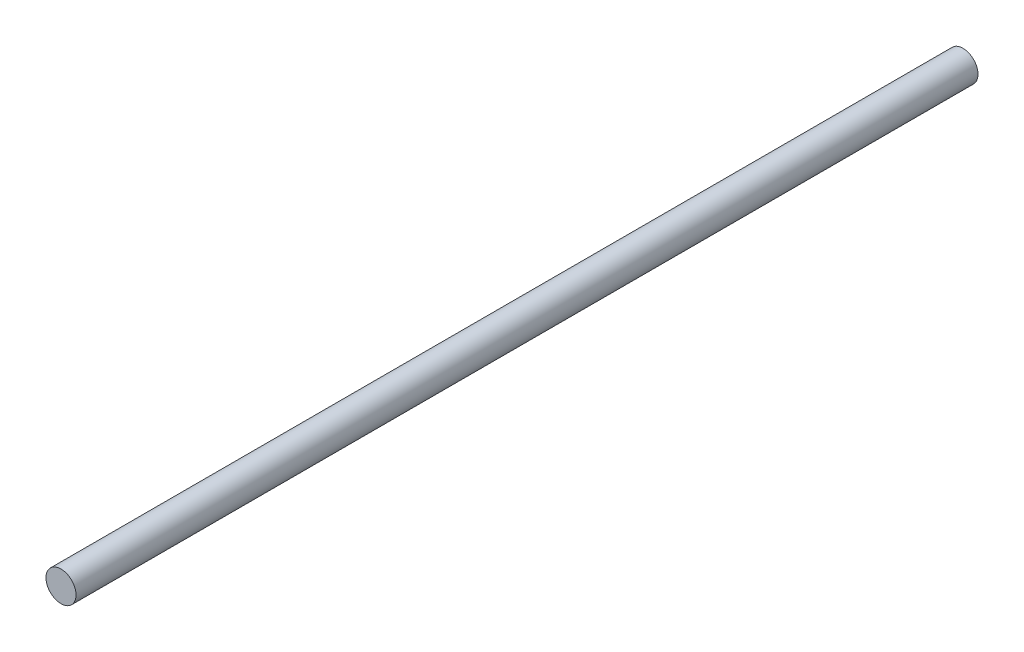
ISO-10303-21;
HEADER;
FILE_DESCRIPTION(('STEP AP214'),'2;1');
FILE_NAME('part.step','',(''),(''),'','','');
FILE_SCHEMA(('AUTOMOTIVE_DESIGN { 1 0 10303 214 1 1 1 1 }'));
ENDSEC;
DATA;
#1=APPLICATION_CONTEXT('core data for automotive mechanical design processes');
#2=APPLICATION_PROTOCOL_DEFINITION('international standard','automotive_design',2000,#1);
#3=PRODUCT_CONTEXT('',#1,'mechanical');
#4=PRODUCT('Part','Part','',(#3));
#5=PRODUCT_RELATED_PRODUCT_CATEGORY('part','',(#4));
#6=PRODUCT_DEFINITION_FORMATION('','',#4);
#7=PRODUCT_DEFINITION_CONTEXT('part definition',#1,'design');
#8=PRODUCT_DEFINITION('design','',#6,#7);
#9=PRODUCT_DEFINITION_SHAPE('','',#8);
#10=(LENGTH_UNIT() NAMED_UNIT(*) SI_UNIT(.MILLI.,.METRE.));
#11=(NAMED_UNIT(*) PLANE_ANGLE_UNIT() SI_UNIT($,.RADIAN.));
#12=(NAMED_UNIT(*) SI_UNIT($,.STERADIAN.) SOLID_ANGLE_UNIT());
#13=UNCERTAINTY_MEASURE_WITH_UNIT(LENGTH_MEASURE(1.E-05),#10,'distance_accuracy_value','');
#14=(GEOMETRIC_REPRESENTATION_CONTEXT(3) GLOBAL_UNCERTAINTY_ASSIGNED_CONTEXT((#13)) GLOBAL_UNIT_ASSIGNED_CONTEXT((#10,
#11,#12)) REPRESENTATION_CONTEXT('',''));
#15=CARTESIAN_POINT('',(0.,0.,0.));
#16=DIRECTION('',(0.,0.,1.));
#17=DIRECTION('',(1.,0.,0.));
#18=AXIS2_PLACEMENT_3D('',#15,#16,#17);
#19=CARTESIAN_POINT('',(0.,0.,300.));
#20=DIRECTION('',(0.,0.,-1.));
#21=DIRECTION('',(-1.,0.,0.));
#22=AXIS2_PLACEMENT_3D('',#19,#20,#21);
#23=CYLINDRICAL_SURFACE('',#22,5.);
#24=CARTESIAN_POINT('',(0.,0.,300.));
#25=DIRECTION('',(0.,0.,1.));
#26=DIRECTION('',(1.,0.,0.));
#27=AXIS2_PLACEMENT_3D('',#24,#25,#26);
#28=CIRCLE('',#27,5.);
#29=CARTESIAN_POINT('',(5.,0.,300.));
#30=VERTEX_POINT('',#29);
#31=EDGE_CURVE('E10',#30,#30,#28,.T.);
#32=ORIENTED_EDGE('',*,*,#31,.F.);
#33=EDGE_LOOP('',(#32));
#34=FACE_BOUND('',#33,.T.);
#35=CARTESIAN_POINT('',(0.,0.,0.));
#36=DIRECTION('',(0.,0.,1.));
#37=DIRECTION('',(1.,0.,0.));
#38=AXIS2_PLACEMENT_3D('',#35,#36,#37);
#39=CIRCLE('',#38,5.);
#40=CARTESIAN_POINT('',(5.,0.,0.));
#41=VERTEX_POINT('',#40);
#42=EDGE_CURVE('E38',#41,#41,#39,.T.);
#43=ORIENTED_EDGE('',*,*,#42,.T.);
#44=EDGE_LOOP('',(#43));
#45=FACE_BOUND('',#44,.T.);
#46=ADVANCED_FACE('F35',(#34,#45),#23,.T.);
#47=CARTESIAN_POINT('',(0.,0.,300.));
#48=DIRECTION('',(0.,0.,1.));
#49=DIRECTION('',(1.,0.,0.));
#50=AXIS2_PLACEMENT_3D('',#47,#48,#49);
#51=PLANE('',#50);
#52=ORIENTED_EDGE('',*,*,#31,.T.);
#53=EDGE_LOOP('',(#52));
#54=FACE_BOUND('',#53,.T.);
#55=ADVANCED_FACE('F50',(#54),#51,.T.);
#56=CARTESIAN_POINT('',(0.,0.,0.));
#57=DIRECTION('',(0.,0.,1.));
#58=DIRECTION('',(1.,0.,0.));
#59=AXIS2_PLACEMENT_3D('',#56,#57,#58);
#60=PLANE('',#59);
#61=ORIENTED_EDGE('',*,*,#42,.F.);
#62=EDGE_LOOP('',(#61));
#63=FACE_BOUND('',#62,.T.);
#64=ADVANCED_FACE('F48',(#63),#60,.F.);
#65=CLOSED_SHELL('',(#46,#55,#64));
#66=MANIFOLD_SOLID_BREP('B2',#65);
#67=ADVANCED_BREP_SHAPE_REPRESENTATION('',(#18,#66),#14);
#68=SHAPE_DEFINITION_REPRESENTATION(#9,#67);
ENDSEC;
END-ISO-10303-21;
